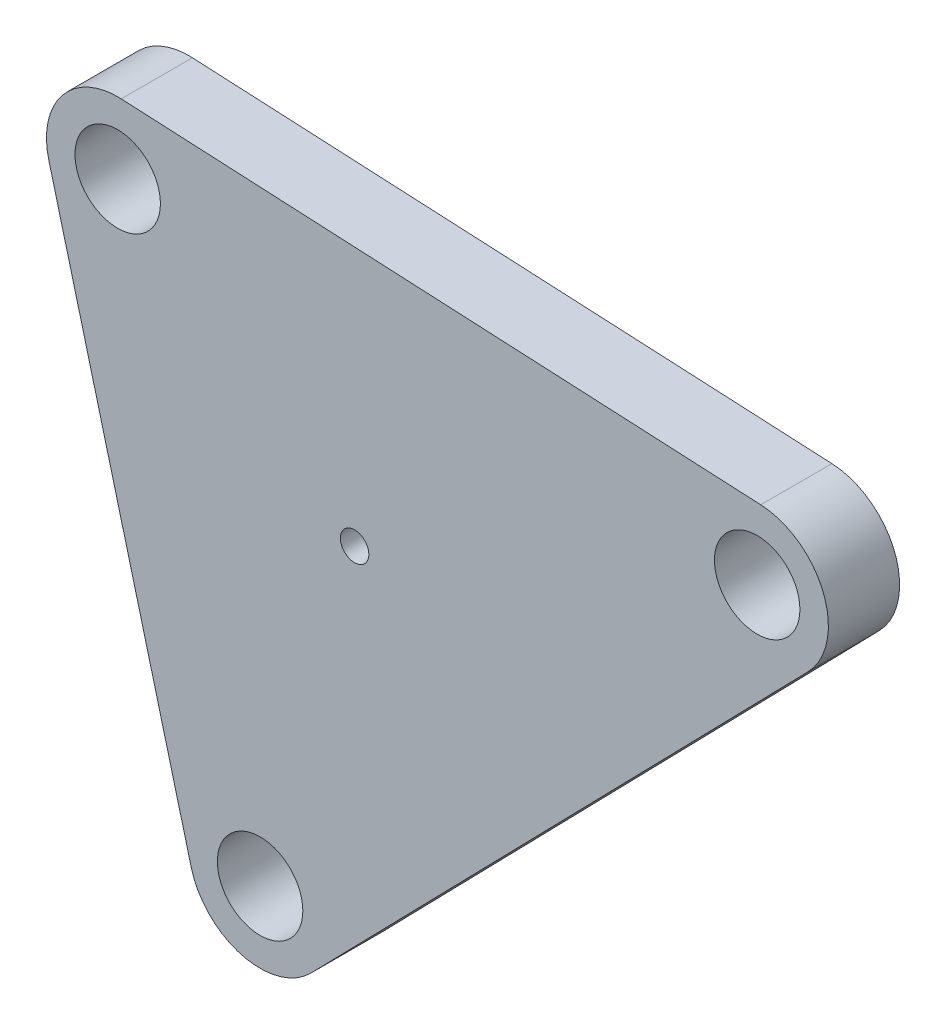
ISO-10303-21;
HEADER;
FILE_DESCRIPTION(('STEP AP214'),'2;1');
FILE_NAME('part.step','',(''),(''),'','','');
FILE_SCHEMA(('AUTOMOTIVE_DESIGN { 1 0 10303 214 1 1 1 1 }'));
ENDSEC;
DATA;
#1=APPLICATION_CONTEXT('core data for automotive mechanical design processes');
#2=APPLICATION_PROTOCOL_DEFINITION('international standard','automotive_design',2000,#1);
#3=PRODUCT_CONTEXT('',#1,'mechanical');
#4=PRODUCT('Part','Part','',(#3));
#5=PRODUCT_RELATED_PRODUCT_CATEGORY('part','',(#4));
#6=PRODUCT_DEFINITION_FORMATION('','',#4);
#7=PRODUCT_DEFINITION_CONTEXT('part definition',#1,'design');
#8=PRODUCT_DEFINITION('design','',#6,#7);
#9=PRODUCT_DEFINITION_SHAPE('','',#8);
#10=(LENGTH_UNIT() NAMED_UNIT(*) SI_UNIT(.MILLI.,.METRE.));
#11=(NAMED_UNIT(*) PLANE_ANGLE_UNIT() SI_UNIT($,.RADIAN.));
#12=(NAMED_UNIT(*) SI_UNIT($,.STERADIAN.) SOLID_ANGLE_UNIT());
#13=UNCERTAINTY_MEASURE_WITH_UNIT(LENGTH_MEASURE(1.E-05),#10,'distance_accuracy_value','');
#14=(GEOMETRIC_REPRESENTATION_CONTEXT(3) GLOBAL_UNCERTAINTY_ASSIGNED_CONTEXT((#13)) GLOBAL_UNIT_ASSIGNED_CONTEXT((#10,
#11,#12)) REPRESENTATION_CONTEXT('',''));
#15=CARTESIAN_POINT('',(0.,0.,0.));
#16=DIRECTION('',(0.,0.,1.));
#17=DIRECTION('',(1.,0.,0.));
#18=AXIS2_PLACEMENT_3D('',#15,#16,#17);
#19=CARTESIAN_POINT('',(7.58222232368378,-5.71752336448602,5.));
#20=DIRECTION('',(0.,0.,1.));
#21=DIRECTION('',(1.,0.,0.));
#22=AXIS2_PLACEMENT_3D('',#19,#20,#21);
#23=PLANE('',#22);
#24=CARTESIAN_POINT('',(17.5822223236839,-43.7175233644859,5.));
#25=DIRECTION('',(0.,0.,1.));
#26=DIRECTION('',(1.,0.,0.));
#27=AXIS2_PLACEMENT_3D('',#24,#25,#26);
#28=CIRCLE('',#27,3.);
#29=CARTESIAN_POINT('',(20.5822223236839,-43.7175233644859,5.));
#30=VERTEX_POINT('',#29);
#31=EDGE_CURVE('E188',#30,#30,#28,.T.);
#32=ORIENTED_EDGE('',*,*,#31,.F.);
#33=EDGE_LOOP('',(#32));
#34=FACE_BOUND('',#33,.T.);
#35=CARTESIAN_POINT('',(7.58222232368378,-5.71752336448602,5.));
#36=DIRECTION('',(0.,0.,1.));
#37=DIRECTION('',(1.,0.,0.));
#38=AXIS2_PLACEMENT_3D('',#35,#36,#37);
#39=CIRCLE('',#38,3.);
#40=CARTESIAN_POINT('',(10.5822223236838,-5.71752336448602,5.));
#41=VERTEX_POINT('',#40);
#42=EDGE_CURVE('E120',#41,#41,#39,.T.);
#43=ORIENTED_EDGE('',*,*,#42,.F.);
#44=EDGE_LOOP('',(#43));
#45=FACE_BOUND('',#44,.T.);
#46=CARTESIAN_POINT('',(7.58222232368378,-5.71752336448602,5.));
#47=DIRECTION('',(0.,0.,1.));
#48=DIRECTION('',(1.,0.,0.));
#49=AXIS2_PLACEMENT_3D('',#46,#47,#48);
#50=CIRCLE('',#49,5.);
#51=CARTESIAN_POINT('',(7.83008624468436,-0.723670795910712,5.));
#52=VERTEX_POINT('',#51);
#53=CARTESIAN_POINT('',(2.74684963737055,-6.98998986088426,5.));
#54=VERTEX_POINT('',#53);
#55=EDGE_CURVE('E127',#52,#54,#50,.T.);
#56=ORIENTED_EDGE('',*,*,#55,.T.);
#57=DIRECTION('',(0.254493299279647,-0.967074537262645,0.));
#58=VECTOR('',#57,1.);
#59=CARTESIAN_POINT('',(2.74684963737055,-6.98998986088426,5.));
#60=LINE('',#59,#58);
#61=CARTESIAN_POINT('',(12.7468496373707,-44.9899898608842,5.));
#62=VERTEX_POINT('',#61);
#63=EDGE_CURVE('E85',#54,#62,#60,.T.);
#64=ORIENTED_EDGE('',*,*,#63,.T.);
#65=CARTESIAN_POINT('',(17.5822223236839,-43.7175233644859,5.));
#66=DIRECTION('',(0.,0.,1.));
#67=DIRECTION('',(1.,0.,0.));
#68=AXIS2_PLACEMENT_3D('',#65,#66,#67);
#69=CIRCLE('',#68,5.);
#70=CARTESIAN_POINT('',(21.1610535568244,-47.2092230945169,5.));
#71=VERTEX_POINT('',#70);
#72=EDGE_CURVE('E98',#62,#71,#69,.T.);
#73=ORIENTED_EDGE('',*,*,#72,.T.);
#74=DIRECTION('',(0.698339946006185,0.7157662466281,0.));
#75=VECTOR('',#74,1.);
#76=CARTESIAN_POINT('',(21.1610535568244,-47.2092230945169,5.));
#77=LINE('',#76,#75);
#78=CARTESIAN_POINT('',(56.0615664285546,-11.4378065423657,5.));
#79=VERTEX_POINT('',#78);
#80=EDGE_CURVE('E92',#71,#79,#77,.T.);
#81=ORIENTED_EDGE('',*,*,#80,.T.);
#82=CARTESIAN_POINT('',(52.4827351954141,-7.94610681233479,5.));
#83=DIRECTION('',(0.,0.,1.));
#84=DIRECTION('',(1.,0.,0.));
#85=AXIS2_PLACEMENT_3D('',#82,#83,#84);
#86=CIRCLE('',#85,5.);
#87=CARTESIAN_POINT('',(52.7305991164147,-2.95225424375948,5.));
#88=VERTEX_POINT('',#87);
#89=EDGE_CURVE('E96',#79,#88,#86,.T.);
#90=ORIENTED_EDGE('',*,*,#89,.T.);
#91=DIRECTION('',(-0.998770513715062,0.0495727842001155,0.));
#92=VECTOR('',#91,1.);
#93=CARTESIAN_POINT('',(52.7305991164147,-2.95225424375948,5.));
#94=LINE('',#93,#92);
#95=EDGE_CURVE('E48',#88,#52,#94,.T.);
#96=ORIENTED_EDGE('',*,*,#95,.T.);
#97=EDGE_LOOP('',(#56,#64,#73,#81,#90,#96));
#98=FACE_BOUND('',#97,.T.);
#99=CARTESIAN_POINT('',(52.4827351954141,-7.94610681233479,5.));
#100=DIRECTION('',(0.,0.,1.));
#101=DIRECTION('',(1.,0.,0.));
#102=AXIS2_PLACEMENT_3D('',#99,#100,#101);
#103=CIRCLE('',#102,3.);
#104=CARTESIAN_POINT('',(55.4827351954141,-7.94610681233479,5.));
#105=VERTEX_POINT('',#104);
#106=EDGE_CURVE('E194',#105,#105,#103,.T.);
#107=ORIENTED_EDGE('',*,*,#106,.F.);
#108=EDGE_LOOP('',(#107));
#109=FACE_BOUND('',#108,.T.);
#110=CARTESIAN_POINT('',(24.2166737720373,-19.7339083537588,5.));
#111=DIRECTION('',(0.,0.,1.));
#112=DIRECTION('',(1.,0.,0.));
#113=AXIS2_PLACEMENT_3D('',#110,#111,#112);
#114=CIRCLE('',#113,1.);
#115=CARTESIAN_POINT('',(25.2166737720373,-19.7339083537588,5.));
#116=VERTEX_POINT('',#115);
#117=EDGE_CURVE('E179',#116,#116,#114,.T.);
#118=ORIENTED_EDGE('',*,*,#117,.F.);
#119=EDGE_LOOP('',(#118));
#120=FACE_BOUND('',#119,.T.);
#121=ADVANCED_FACE('F31',(#34,#45,#98,#109,#120),#23,.T.);
#122=CARTESIAN_POINT('',(7.58222232368378,-5.71752336448602,0.));
#123=DIRECTION('',(0.,0.,1.));
#124=DIRECTION('',(1.,0.,0.));
#125=AXIS2_PLACEMENT_3D('',#122,#123,#124);
#126=PLANE('',#125);
#127=CARTESIAN_POINT('',(17.5822223236839,-43.7175233644859,0.));
#128=DIRECTION('',(0.,0.,1.));
#129=DIRECTION('',(1.,0.,0.));
#130=AXIS2_PLACEMENT_3D('',#127,#128,#129);
#131=CIRCLE('',#130,3.);
#132=CARTESIAN_POINT('',(20.5822223236839,-43.7175233644859,0.));
#133=VERTEX_POINT('',#132);
#134=EDGE_CURVE('E185',#133,#133,#131,.T.);
#135=ORIENTED_EDGE('',*,*,#134,.T.);
#136=EDGE_LOOP('',(#135));
#137=FACE_BOUND('',#136,.T.);
#138=CARTESIAN_POINT('',(7.58222232368378,-5.71752336448602,0.));
#139=DIRECTION('',(0.,0.,1.));
#140=DIRECTION('',(1.,0.,0.));
#141=AXIS2_PLACEMENT_3D('',#138,#139,#140);
#142=CIRCLE('',#141,3.);
#143=CARTESIAN_POINT('',(10.5822223236838,-5.71752336448602,0.));
#144=VERTEX_POINT('',#143);
#145=EDGE_CURVE('E197',#144,#144,#142,.T.);
#146=ORIENTED_EDGE('',*,*,#145,.T.);
#147=EDGE_LOOP('',(#146));
#148=FACE_BOUND('',#147,.T.);
#149=CARTESIAN_POINT('',(7.58222232368378,-5.71752336448602,0.));
#150=DIRECTION('',(0.,0.,1.));
#151=DIRECTION('',(1.,0.,0.));
#152=AXIS2_PLACEMENT_3D('',#149,#150,#151);
#153=CIRCLE('',#152,5.);
#154=CARTESIAN_POINT('',(7.83008624468436,-0.723670795910712,0.));
#155=VERTEX_POINT('',#154);
#156=CARTESIAN_POINT('',(2.74684963737055,-6.98998986088426,0.));
#157=VERTEX_POINT('',#156);
#158=EDGE_CURVE('E116',#155,#157,#153,.T.);
#159=ORIENTED_EDGE('',*,*,#158,.F.);
#160=DIRECTION('',(-0.998770513715062,0.0495727842001155,0.));
#161=VECTOR('',#160,1.);
#162=CARTESIAN_POINT('',(52.7305991164147,-2.95225424375948,0.));
#163=LINE('',#162,#161);
#164=CARTESIAN_POINT('',(52.7305991164147,-2.95225424375948,0.));
#165=VERTEX_POINT('',#164);
#166=EDGE_CURVE('E77',#165,#155,#163,.T.);
#167=ORIENTED_EDGE('',*,*,#166,.F.);
#168=CARTESIAN_POINT('',(52.4827351954141,-7.94610681233479,0.));
#169=DIRECTION('',(0.,0.,1.));
#170=DIRECTION('',(1.,0.,0.));
#171=AXIS2_PLACEMENT_3D('',#168,#169,#170);
#172=CIRCLE('',#171,5.);
#173=CARTESIAN_POINT('',(56.0615664285546,-11.4378065423657,0.));
#174=VERTEX_POINT('',#173);
#175=EDGE_CURVE('E71',#174,#165,#172,.T.);
#176=ORIENTED_EDGE('',*,*,#175,.F.);
#177=DIRECTION('',(0.698339946006185,0.7157662466281,0.));
#178=VECTOR('',#177,1.);
#179=CARTESIAN_POINT('',(21.1610535568244,-47.2092230945169,0.));
#180=LINE('',#179,#178);
#181=CARTESIAN_POINT('',(21.1610535568244,-47.2092230945169,0.));
#182=VERTEX_POINT('',#181);
#183=EDGE_CURVE('E106',#182,#174,#180,.T.);
#184=ORIENTED_EDGE('',*,*,#183,.F.);
#185=CARTESIAN_POINT('',(17.5822223236839,-43.7175233644859,0.));
#186=DIRECTION('',(0.,0.,1.));
#187=DIRECTION('',(1.,0.,0.));
#188=AXIS2_PLACEMENT_3D('',#185,#186,#187);
#189=CIRCLE('',#188,5.);
#190=CARTESIAN_POINT('',(12.7468496373707,-44.9899898608842,0.));
#191=VERTEX_POINT('',#190);
#192=EDGE_CURVE('E122',#191,#182,#189,.T.);
#193=ORIENTED_EDGE('',*,*,#192,.F.);
#194=DIRECTION('',(0.254493299279647,-0.967074537262645,0.));
#195=VECTOR('',#194,1.);
#196=CARTESIAN_POINT('',(2.74684963737055,-6.98998986088426,0.));
#197=LINE('',#196,#195);
#198=EDGE_CURVE('E119',#157,#191,#197,.T.);
#199=ORIENTED_EDGE('',*,*,#198,.F.);
#200=EDGE_LOOP('',(#159,#167,#176,#184,#193,#199));
#201=FACE_BOUND('',#200,.T.);
#202=CARTESIAN_POINT('',(52.4827351954141,-7.94610681233479,0.));
#203=DIRECTION('',(0.,0.,1.));
#204=DIRECTION('',(1.,0.,0.));
#205=AXIS2_PLACEMENT_3D('',#202,#203,#204);
#206=CIRCLE('',#205,3.);
#207=CARTESIAN_POINT('',(55.4827351954141,-7.94610681233479,0.));
#208=VERTEX_POINT('',#207);
#209=EDGE_CURVE('E191',#208,#208,#206,.T.);
#210=ORIENTED_EDGE('',*,*,#209,.T.);
#211=EDGE_LOOP('',(#210));
#212=FACE_BOUND('',#211,.T.);
#213=CARTESIAN_POINT('',(24.2166737720373,-19.7339083537588,0.));
#214=DIRECTION('',(0.,0.,1.));
#215=DIRECTION('',(1.,0.,0.));
#216=AXIS2_PLACEMENT_3D('',#213,#214,#215);
#217=CIRCLE('',#216,1.);
#218=CARTESIAN_POINT('',(25.2166737720373,-19.7339083537588,0.));
#219=VERTEX_POINT('',#218);
#220=EDGE_CURVE('E182',#219,#219,#217,.T.);
#221=ORIENTED_EDGE('',*,*,#220,.T.);
#222=EDGE_LOOP('',(#221));
#223=FACE_BOUND('',#222,.T.);
#224=ADVANCED_FACE('F136',(#137,#148,#201,#212,#223),#126,.F.);
#225=CARTESIAN_POINT('',(7.58222232368378,-5.71752336448602,5.));
#226=DIRECTION('',(0.,0.,-1.));
#227=DIRECTION('',(-1.,0.,0.));
#228=AXIS2_PLACEMENT_3D('',#225,#226,#227);
#229=CYLINDRICAL_SURFACE('',#228,5.);
#230=ORIENTED_EDGE('',*,*,#158,.T.);
#231=DIRECTION('',(0.,0.,-1.));
#232=VECTOR('',#231,1.);
#233=CARTESIAN_POINT('',(2.74684963737055,-6.98998986088426,5.));
#234=LINE('',#233,#232);
#235=EDGE_CURVE('E11',#54,#157,#234,.T.);
#236=ORIENTED_EDGE('',*,*,#235,.F.);
#237=ORIENTED_EDGE('',*,*,#55,.F.);
#238=DIRECTION('',(0.,0.,-1.));
#239=VECTOR('',#238,1.);
#240=CARTESIAN_POINT('',(7.83008624468436,-0.723670795910712,5.));
#241=LINE('',#240,#239);
#242=EDGE_CURVE('E112',#52,#155,#241,.T.);
#243=ORIENTED_EDGE('',*,*,#242,.T.);
#244=EDGE_LOOP('',(#230,#236,#237,#243));
#245=FACE_BOUND('',#244,.T.);
#246=ADVANCED_FACE('F33',(#245),#229,.T.);
#247=CARTESIAN_POINT('',(2.74684963737055,-6.98998986088426,5.));
#248=DIRECTION('',(0.967074537262645,0.254493299279647,0.));
#249=DIRECTION('',(-0.254493299279648,0.967074537262646,0.));
#250=AXIS2_PLACEMENT_3D('',#247,#248,#249);
#251=PLANE('',#250);
#252=ORIENTED_EDGE('',*,*,#198,.T.);
#253=DIRECTION('',(0.,0.,-1.));
#254=VECTOR('',#253,1.);
#255=CARTESIAN_POINT('',(12.7468496373707,-44.9899898608842,5.));
#256=LINE('',#255,#254);
#257=EDGE_CURVE('E40',#62,#191,#256,.T.);
#258=ORIENTED_EDGE('',*,*,#257,.F.);
#259=ORIENTED_EDGE('',*,*,#63,.F.);
#260=ORIENTED_EDGE('',*,*,#235,.T.);
#261=EDGE_LOOP('',(#252,#258,#259,#260));
#262=FACE_BOUND('',#261,.T.);
#263=ADVANCED_FACE('F254',(#262),#251,.F.);
#264=CARTESIAN_POINT('',(17.5822223236839,-43.7175233644859,5.));
#265=DIRECTION('',(0.,0.,-1.));
#266=DIRECTION('',(-1.,0.,0.));
#267=AXIS2_PLACEMENT_3D('',#264,#265,#266);
#268=CYLINDRICAL_SURFACE('',#267,5.);
#269=ORIENTED_EDGE('',*,*,#192,.T.);
#270=DIRECTION('',(0.,0.,-1.));
#271=VECTOR('',#270,1.);
#272=CARTESIAN_POINT('',(21.1610535568244,-47.2092230945169,5.));
#273=LINE('',#272,#271);
#274=EDGE_CURVE('E107',#71,#182,#273,.T.);
#275=ORIENTED_EDGE('',*,*,#274,.F.);
#276=ORIENTED_EDGE('',*,*,#72,.F.);
#277=ORIENTED_EDGE('',*,*,#257,.T.);
#278=EDGE_LOOP('',(#269,#275,#276,#277));
#279=FACE_BOUND('',#278,.T.);
#280=ADVANCED_FACE('F133',(#279),#268,.T.);
#281=CARTESIAN_POINT('',(21.1610535568244,-47.2092230945169,5.));
#282=DIRECTION('',(-0.7157662466281,0.698339946006185,0.));
#283=DIRECTION('',(-0.698339946006186,-0.7157662466281,0.));
#284=AXIS2_PLACEMENT_3D('',#281,#282,#283);
#285=PLANE('',#284);
#286=ORIENTED_EDGE('',*,*,#183,.T.);
#287=DIRECTION('',(0.,0.,-1.));
#288=VECTOR('',#287,1.);
#289=CARTESIAN_POINT('',(56.0615664285546,-11.4378065423657,5.));
#290=LINE('',#289,#288);
#291=EDGE_CURVE('E103',#79,#174,#290,.T.);
#292=ORIENTED_EDGE('',*,*,#291,.F.);
#293=ORIENTED_EDGE('',*,*,#80,.F.);
#294=ORIENTED_EDGE('',*,*,#274,.T.);
#295=EDGE_LOOP('',(#286,#292,#293,#294));
#296=FACE_BOUND('',#295,.T.);
#297=ADVANCED_FACE('F104',(#296),#285,.F.);
#298=CARTESIAN_POINT('',(52.4827351954141,-7.94610681233479,5.));
#299=DIRECTION('',(0.,0.,-1.));
#300=DIRECTION('',(-1.,0.,0.));
#301=AXIS2_PLACEMENT_3D('',#298,#299,#300);
#302=CYLINDRICAL_SURFACE('',#301,5.);
#303=ORIENTED_EDGE('',*,*,#175,.T.);
#304=DIRECTION('',(0.,0.,-1.));
#305=VECTOR('',#304,1.);
#306=CARTESIAN_POINT('',(52.7305991164147,-2.95225424375948,5.));
#307=LINE('',#306,#305);
#308=EDGE_CURVE('E108',#88,#165,#307,.T.);
#309=ORIENTED_EDGE('',*,*,#308,.F.);
#310=ORIENTED_EDGE('',*,*,#89,.F.);
#311=ORIENTED_EDGE('',*,*,#291,.T.);
#312=EDGE_LOOP('',(#303,#309,#310,#311));
#313=FACE_BOUND('',#312,.T.);
#314=ADVANCED_FACE('F110',(#313),#302,.T.);
#315=CARTESIAN_POINT('',(52.7305991164147,-2.95225424375948,5.));
#316=DIRECTION('',(-0.0495727842001155,-0.998770513715062,0.));
#317=DIRECTION('',(0.998770513715062,-0.0495727842001155,0.));
#318=AXIS2_PLACEMENT_3D('',#315,#316,#317);
#319=PLANE('',#318);
#320=ORIENTED_EDGE('',*,*,#166,.T.);
#321=ORIENTED_EDGE('',*,*,#242,.F.);
#322=ORIENTED_EDGE('',*,*,#95,.F.);
#323=ORIENTED_EDGE('',*,*,#308,.T.);
#324=EDGE_LOOP('',(#320,#321,#322,#323));
#325=FACE_BOUND('',#324,.T.);
#326=ADVANCED_FACE('F141',(#325),#319,.F.);
#327=CARTESIAN_POINT('',(7.58222232368378,-5.71752336448602,5.));
#328=DIRECTION('',(0.,0.,-1.));
#329=DIRECTION('',(-1.,0.,0.));
#330=AXIS2_PLACEMENT_3D('',#327,#328,#329);
#331=CYLINDRICAL_SURFACE('',#330,3.);
#332=ORIENTED_EDGE('',*,*,#42,.T.);
#333=EDGE_LOOP('',(#332));
#334=FACE_BOUND('',#333,.T.);
#335=ORIENTED_EDGE('',*,*,#145,.F.);
#336=EDGE_LOOP('',(#335));
#337=FACE_BOUND('',#336,.T.);
#338=ADVANCED_FACE('F143',(#334,#337),#331,.F.);
#339=CARTESIAN_POINT('',(52.4827351954141,-7.94610681233479,5.));
#340=DIRECTION('',(0.,0.,-1.));
#341=DIRECTION('',(-1.,0.,0.));
#342=AXIS2_PLACEMENT_3D('',#339,#340,#341);
#343=CYLINDRICAL_SURFACE('',#342,3.);
#344=ORIENTED_EDGE('',*,*,#106,.T.);
#345=EDGE_LOOP('',(#344));
#346=FACE_BOUND('',#345,.T.);
#347=ORIENTED_EDGE('',*,*,#209,.F.);
#348=EDGE_LOOP('',(#347));
#349=FACE_BOUND('',#348,.T.);
#350=ADVANCED_FACE('F149',(#346,#349),#343,.F.);
#351=CARTESIAN_POINT('',(17.5822223236839,-43.7175233644859,5.));
#352=DIRECTION('',(0.,0.,-1.));
#353=DIRECTION('',(-1.,0.,0.));
#354=AXIS2_PLACEMENT_3D('',#351,#352,#353);
#355=CYLINDRICAL_SURFACE('',#354,3.);
#356=ORIENTED_EDGE('',*,*,#31,.T.);
#357=EDGE_LOOP('',(#356));
#358=FACE_BOUND('',#357,.T.);
#359=ORIENTED_EDGE('',*,*,#134,.F.);
#360=EDGE_LOOP('',(#359));
#361=FACE_BOUND('',#360,.T.);
#362=ADVANCED_FACE('F166',(#358,#361),#355,.F.);
#363=CARTESIAN_POINT('',(24.2166737720373,-19.7339083537588,5.));
#364=DIRECTION('',(0.,0.,-1.));
#365=DIRECTION('',(-1.,0.,0.));
#366=AXIS2_PLACEMENT_3D('',#363,#364,#365);
#367=CYLINDRICAL_SURFACE('',#366,1.);
#368=ORIENTED_EDGE('',*,*,#117,.T.);
#369=EDGE_LOOP('',(#368));
#370=FACE_BOUND('',#369,.T.);
#371=ORIENTED_EDGE('',*,*,#220,.F.);
#372=EDGE_LOOP('',(#371));
#373=FACE_BOUND('',#372,.T.);
#374=ADVANCED_FACE('F170',(#370,#373),#367,.F.);
#375=CLOSED_SHELL('',(#121,#224,#246,#263,#280,#297,#314,#326,#338,#350,#362,#374));
#376=MANIFOLD_SOLID_BREP('B2',#375);
#377=ADVANCED_BREP_SHAPE_REPRESENTATION('',(#18,#376),#14);
#378=SHAPE_DEFINITION_REPRESENTATION(#9,#377);
ENDSEC;
END-ISO-10303-21;
